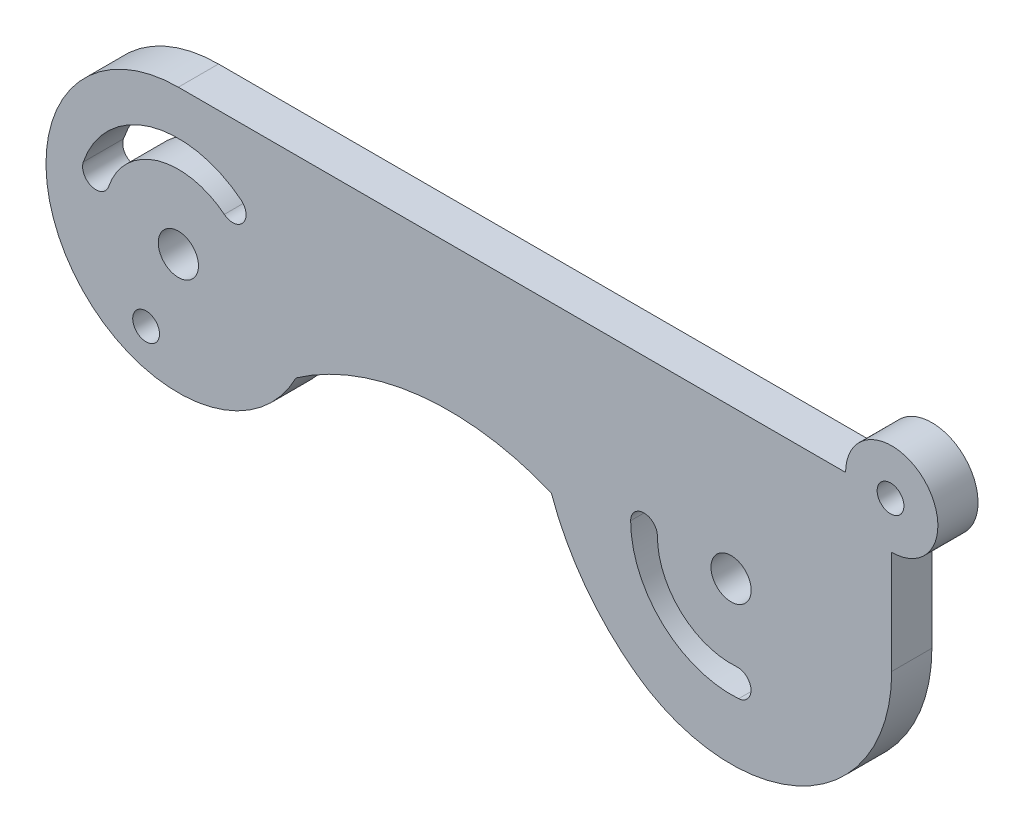
ISO-10303-21;
HEADER;
FILE_DESCRIPTION(('STEP AP214'),'2;1');
FILE_NAME('part.step','',(''),(''),'','','');
FILE_SCHEMA(('AUTOMOTIVE_DESIGN { 1 0 10303 214 1 1 1 1 }'));
ENDSEC;
DATA;
#1=APPLICATION_CONTEXT('core data for automotive mechanical design processes');
#2=APPLICATION_PROTOCOL_DEFINITION('international standard','automotive_design',2000,#1);
#3=PRODUCT_CONTEXT('',#1,'mechanical');
#4=PRODUCT('Part','Part','',(#3));
#5=PRODUCT_RELATED_PRODUCT_CATEGORY('part','',(#4));
#6=PRODUCT_DEFINITION_FORMATION('','',#4);
#7=PRODUCT_DEFINITION_CONTEXT('part definition',#1,'design');
#8=PRODUCT_DEFINITION('design','',#6,#7);
#9=PRODUCT_DEFINITION_SHAPE('','',#8);
#10=(LENGTH_UNIT() NAMED_UNIT(*) SI_UNIT(.MILLI.,.METRE.));
#11=(NAMED_UNIT(*) PLANE_ANGLE_UNIT() SI_UNIT($,.RADIAN.));
#12=(NAMED_UNIT(*) SI_UNIT($,.STERADIAN.) SOLID_ANGLE_UNIT());
#13=UNCERTAINTY_MEASURE_WITH_UNIT(LENGTH_MEASURE(1.E-05),#10,'distance_accuracy_value','');
#14=(GEOMETRIC_REPRESENTATION_CONTEXT(3) GLOBAL_UNCERTAINTY_ASSIGNED_CONTEXT((#13)) GLOBAL_UNIT_ASSIGNED_CONTEXT((#10,
#11,#12)) REPRESENTATION_CONTEXT('',''));
#15=CARTESIAN_POINT('',(0.,0.,0.));
#16=DIRECTION('',(0.,0.,1.));
#17=DIRECTION('',(1.,0.,0.));
#18=AXIS2_PLACEMENT_3D('',#15,#16,#17);
#19=CARTESIAN_POINT('',(44.48908528407,-10.5117961817289,3.));
#20=DIRECTION('',(0.,0.,1.));
#21=DIRECTION('',(1.,0.,0.));
#22=AXIS2_PLACEMENT_3D('',#19,#20,#21);
#23=PLANE('',#22);
#24=CARTESIAN_POINT('',(0.80161913468884,-16.0354079073061,3.));
#25=DIRECTION('',(0.,0.,1.));
#26=DIRECTION('',(1.,0.,0.));
#27=AXIS2_PLACEMENT_3D('',#24,#25,#26);
#28=CIRCLE('',#27,1.);
#29=CARTESIAN_POINT('',(1.80161913468884,-16.0354079073061,3.));
#30=VERTEX_POINT('',#29);
#31=EDGE_CURVE('E377',#30,#30,#28,.T.);
#32=ORIENTED_EDGE('',*,*,#31,.F.);
#33=EDGE_LOOP('',(#32));
#34=FACE_BOUND('',#33,.T.);
#35=CARTESIAN_POINT('',(44.48908528407,-10.5117961817289,3.));
#36=DIRECTION('',(0.,0.,1.));
#37=DIRECTION('',(1.,0.,0.));
#38=AXIS2_PLACEMENT_3D('',#35,#36,#37);
#39=CIRCLE('',#38,7.5);
#40=CARTESIAN_POINT('',(36.98908528407,-10.5117961817289,3.));
#41=VERTEX_POINT('',#40);
#42=CARTESIAN_POINT('',(45.0557519507366,-17.9903581349984,3.));
#43=VERTEX_POINT('',#42);
#44=EDGE_CURVE('E189',#41,#43,#39,.T.);
#45=ORIENTED_EDGE('',*,*,#44,.F.);
#46=CARTESIAN_POINT('',(37.98908528407,-10.5117961817289,3.));
#47=DIRECTION('',(0.,0.,1.));
#48=DIRECTION('',(1.,0.,0.));
#49=AXIS2_PLACEMENT_3D('',#46,#47,#48);
#50=CIRCLE('',#49,1.);
#51=CARTESIAN_POINT('',(38.98908528407,-10.5117961817289,3.));
#52=VERTEX_POINT('',#51);
#53=EDGE_CURVE('E187',#52,#41,#50,.T.);
#54=ORIENTED_EDGE('',*,*,#53,.F.);
#55=CARTESIAN_POINT('',(44.48908528407,-10.5117961817289,3.));
#56=DIRECTION('',(0.,0.,-1.));
#57=DIRECTION('',(1.,0.,0.));
#58=AXIS2_PLACEMENT_3D('',#55,#56,#57);
#59=CIRCLE('',#58,5.5);
#60=CARTESIAN_POINT('',(44.9046408396775,-15.9960749474559,3.));
#61=VERTEX_POINT('',#60);
#62=EDGE_CURVE('E195',#61,#52,#59,.T.);
#63=ORIENTED_EDGE('',*,*,#62,.F.);
#64=CARTESIAN_POINT('',(44.9801963952425,-16.9932165412244,3.));
#65=DIRECTION('',(0.,0.,1.));
#66=DIRECTION('',(-1.,0.,0.));
#67=AXIS2_PLACEMENT_3D('',#64,#65,#66);
#68=CIRCLE('',#67,1.);
#69=EDGE_CURVE('E192',#43,#61,#68,.T.);
#70=ORIENTED_EDGE('',*,*,#69,.F.);
#71=EDGE_LOOP('',(#45,#54,#63,#70));
#72=FACE_BOUND('',#71,.T.);
#73=CARTESIAN_POINT('',(56.3987088279771,0.638507612801557,3.));
#74=DIRECTION('',(0.,0.,1.));
#75=DIRECTION('',(1.,0.,0.));
#76=AXIS2_PLACEMENT_3D('',#73,#74,#75);
#77=CIRCLE('',#76,0.999999999999998);
#78=CARTESIAN_POINT('',(57.3987088279771,0.638507612801557,3.));
#79=VERTEX_POINT('',#78);
#80=EDGE_CURVE('E218',#79,#79,#77,.T.);
#81=ORIENTED_EDGE('',*,*,#80,.F.);
#82=EDGE_LOOP('',(#81));
#83=FACE_BOUND('',#82,.T.);
#84=CARTESIAN_POINT('',(44.48908528407,-10.5117961817289,3.));
#85=DIRECTION('',(0.,0.,1.));
#86=DIRECTION('',(1.,0.,0.));
#87=AXIS2_PLACEMENT_3D('',#84,#85,#86);
#88=CIRCLE('',#87,12.0000000000002);
#89=CARTESIAN_POINT('',(37.4038600068401,-20.196814652073,3.));
#90=VERTEX_POINT('',#89);
#91=CARTESIAN_POINT('',(56.48908528407,-10.5117961817289,3.));
#92=VERTEX_POINT('',#91);
#93=EDGE_CURVE('E230',#90,#92,#88,.T.);
#94=ORIENTED_EDGE('',*,*,#93,.T.);
#95=DIRECTION('',(0.,1.,0.));
#96=VECTOR('',#95,1.);
#97=CARTESIAN_POINT('',(56.48908528407,-2.80772358580675,3.));
#98=LINE('',#97,#96);
#99=CARTESIAN_POINT('',(56.48908528407,-2.80772358580675,3.));
#100=VERTEX_POINT('',#99);
#101=EDGE_CURVE('E233',#92,#100,#98,.T.);
#102=ORIENTED_EDGE('',*,*,#101,.T.);
#103=CARTESIAN_POINT('',(56.48908528407,0.63850761280156,3.));
#104=DIRECTION('',(0.,0.,1.));
#105=DIRECTION('',(1.,0.,0.));
#106=AXIS2_PLACEMENT_3D('',#103,#104,#105);
#107=CIRCLE('',#106,3.4462311986083);
#108=CARTESIAN_POINT('',(53.0428540854617,0.638507612801558,3.));
#109=VERTEX_POINT('',#108);
#110=EDGE_CURVE('E236',#100,#109,#107,.T.);
#111=ORIENTED_EDGE('',*,*,#110,.T.);
#112=DIRECTION('',(-1.,0.,0.));
#113=VECTOR('',#112,1.);
#114=CARTESIAN_POINT('',(53.0428540854617,0.638507612801558,3.));
#115=LINE('',#114,#113);
#116=CARTESIAN_POINT('',(3.20898301396284,0.638507612801559,3.));
#117=VERTEX_POINT('',#116);
#118=EDGE_CURVE('E238',#109,#117,#115,.T.);
#119=ORIENTED_EDGE('',*,*,#118,.T.);
#120=CARTESIAN_POINT('',(3.20898301396284,-9.24751623575377,3.));
#121=DIRECTION('',(0.,0.,1.));
#122=DIRECTION('',(1.,0.,0.));
#123=AXIS2_PLACEMENT_3D('',#120,#121,#122);
#124=CIRCLE('',#123,9.88602384855533);
#125=CARTESIAN_POINT('',(12.0011096475142,-13.7676906564816,3.));
#126=VERTEX_POINT('',#125);
#127=EDGE_CURVE('E240',#117,#126,#124,.T.);
#128=ORIENTED_EDGE('',*,*,#127,.T.);
#129=CARTESIAN_POINT('',(23.4460927902447,-30.169286946557,3.));
#130=DIRECTION('',(0.,0.,-1.));
#131=DIRECTION('',(-1.,0.,0.));
#132=AXIS2_PLACEMENT_3D('',#129,#130,#131);
#133=CIRCLE('',#132,20.);
#134=CARTESIAN_POINT('',(31.0638093902366,-11.6768454148879,3.));
#135=VERTEX_POINT('',#134);
#136=EDGE_CURVE('E242',#126,#135,#133,.T.);
#137=ORIENTED_EDGE('',*,*,#136,.T.);
#138=CARTESIAN_POINT('',(48.0316979226848,-5.66928694655705,3.));
#139=DIRECTION('',(0.,0.,1.));
#140=DIRECTION('',(1.,0.,0.));
#141=AXIS2_PLACEMENT_3D('',#138,#139,#140);
#142=CIRCLE('',#141,18.);
#143=EDGE_CURVE('E244',#135,#90,#142,.T.);
#144=ORIENTED_EDGE('',*,*,#143,.T.);
#145=EDGE_LOOP('',(#94,#102,#111,#119,#128,#137,#144));
#146=FACE_BOUND('',#145,.T.);
#147=CARTESIAN_POINT('',(44.48908528407,-10.5117961817289,3.));
#148=DIRECTION('',(0.,0.,1.));
#149=DIRECTION('',(1.,0.,0.));
#150=AXIS2_PLACEMENT_3D('',#147,#148,#149);
#151=CIRCLE('',#150,1.5);
#152=CARTESIAN_POINT('',(45.98908528407,-10.5117961817289,3.));
#153=VERTEX_POINT('',#152);
#154=EDGE_CURVE('E224',#153,#153,#151,.T.);
#155=ORIENTED_EDGE('',*,*,#154,.F.);
#156=EDGE_LOOP('',(#155));
#157=FACE_BOUND('',#156,.T.);
#158=CARTESIAN_POINT('',(3.20898301396283,-10.169286946557,3.));
#159=DIRECTION('',(0.,0.,1.));
#160=DIRECTION('',(1.,0.,0.));
#161=AXIS2_PLACEMENT_3D('',#158,#159,#160);
#162=CIRCLE('',#161,1.5);
#163=CARTESIAN_POINT('',(4.70898301396283,-10.169286946557,3.));
#164=VERTEX_POINT('',#163);
#165=EDGE_CURVE('E181',#164,#164,#162,.T.);
#166=ORIENTED_EDGE('',*,*,#165,.F.);
#167=EDGE_LOOP('',(#166));
#168=FACE_BOUND('',#167,.T.);
#169=CARTESIAN_POINT('',(3.20898301396283,-10.169286946557,3.));
#170=DIRECTION('',(0.,0.,1.));
#171=DIRECTION('',(1.,0.,0.));
#172=AXIS2_PLACEMENT_3D('',#169,#170,#171);
#173=CIRCLE('',#172,7.5);
#174=CARTESIAN_POINT('',(7.89034571050594,-4.30969282209632,3.));
#175=VERTEX_POINT('',#174);
#176=CARTESIAN_POINT('',(-3.89022161468151,-7.75034220956226,3.));
#177=VERTEX_POINT('',#176);
#178=EDGE_CURVE('E152',#175,#177,#173,.T.);
#179=ORIENTED_EDGE('',*,*,#178,.F.);
#180=CARTESIAN_POINT('',(7.26616401763353,-5.09097203869108,3.));
#181=DIRECTION('',(0.,0.,1.));
#182=DIRECTION('',(-1.,0.,0.));
#183=AXIS2_PLACEMENT_3D('',#180,#181,#182);
#184=CIRCLE('',#183,1.);
#185=CARTESIAN_POINT('',(6.64198232476111,-5.87225125528585,3.));
#186=VERTEX_POINT('',#185);
#187=EDGE_CURVE('E144',#186,#175,#184,.T.);
#188=ORIENTED_EDGE('',*,*,#187,.F.);
#189=CARTESIAN_POINT('',(3.20898301396283,-10.169286946557,3.));
#190=DIRECTION('',(0.,0.,-1.));
#191=DIRECTION('',(1.,0.,0.));
#192=AXIS2_PLACEMENT_3D('',#189,#190,#191);
#193=CIRCLE('',#192,5.5);
#194=CARTESIAN_POINT('',(-1.99710038037635,-8.39539413942753,3.));
#195=VERTEX_POINT('',#194);
#196=EDGE_CURVE('E166',#195,#186,#193,.T.);
#197=ORIENTED_EDGE('',*,*,#196,.F.);
#198=CARTESIAN_POINT('',(-2.94366099752893,-8.07286817449489,3.));
#199=DIRECTION('',(0.,0.,1.));
#200=DIRECTION('',(1.,0.,0.));
#201=AXIS2_PLACEMENT_3D('',#198,#199,#200);
#202=CIRCLE('',#201,1.);
#203=EDGE_CURVE('E164',#177,#195,#202,.T.);
#204=ORIENTED_EDGE('',*,*,#203,.F.);
#205=EDGE_LOOP('',(#179,#188,#197,#204));
#206=FACE_BOUND('',#205,.T.);
#207=ADVANCED_FACE('F36',(#34,#72,#83,#146,#157,#168,#206),#23,.T.);
#208=CARTESIAN_POINT('',(44.48908528407,-10.5117961817289,0.));
#209=DIRECTION('',(0.,0.,1.));
#210=DIRECTION('',(1.,0.,0.));
#211=AXIS2_PLACEMENT_3D('',#208,#209,#210);
#212=PLANE('',#211);
#213=CARTESIAN_POINT('',(0.80161913468884,-16.0354079073061,0.));
#214=DIRECTION('',(0.,0.,1.));
#215=DIRECTION('',(1.,0.,0.));
#216=AXIS2_PLACEMENT_3D('',#213,#214,#215);
#217=CIRCLE('',#216,1.);
#218=CARTESIAN_POINT('',(1.80161913468884,-16.0354079073061,0.));
#219=VERTEX_POINT('',#218);
#220=EDGE_CURVE('E40',#219,#219,#217,.T.);
#221=ORIENTED_EDGE('',*,*,#220,.T.);
#222=EDGE_LOOP('',(#221));
#223=FACE_BOUND('',#222,.T.);
#224=CARTESIAN_POINT('',(3.20898301396283,-10.169286946557,0.));
#225=DIRECTION('',(0.,0.,1.));
#226=DIRECTION('',(1.,0.,0.));
#227=AXIS2_PLACEMENT_3D('',#224,#225,#226);
#228=CIRCLE('',#227,1.5);
#229=CARTESIAN_POINT('',(4.70898301396283,-10.169286946557,0.));
#230=VERTEX_POINT('',#229);
#231=EDGE_CURVE('E160',#230,#230,#228,.T.);
#232=ORIENTED_EDGE('',*,*,#231,.T.);
#233=EDGE_LOOP('',(#232));
#234=FACE_BOUND('',#233,.T.);
#235=CARTESIAN_POINT('',(37.98908528407,-10.5117961817289,0.));
#236=DIRECTION('',(0.,0.,1.));
#237=DIRECTION('',(1.,0.,0.));
#238=AXIS2_PLACEMENT_3D('',#235,#236,#237);
#239=CIRCLE('',#238,1.);
#240=CARTESIAN_POINT('',(38.98908528407,-10.5117961817289,0.));
#241=VERTEX_POINT('',#240);
#242=CARTESIAN_POINT('',(36.98908528407,-10.5117961817289,0.));
#243=VERTEX_POINT('',#242);
#244=EDGE_CURVE('E184',#241,#243,#239,.T.);
#245=ORIENTED_EDGE('',*,*,#244,.T.);
#246=CARTESIAN_POINT('',(44.48908528407,-10.5117961817289,0.));
#247=DIRECTION('',(0.,0.,1.));
#248=DIRECTION('',(1.,0.,0.));
#249=AXIS2_PLACEMENT_3D('',#246,#247,#248);
#250=CIRCLE('',#249,7.5);
#251=CARTESIAN_POINT('',(45.0557519507366,-17.9903581349984,0.));
#252=VERTEX_POINT('',#251);
#253=EDGE_CURVE('E200',#243,#252,#250,.T.);
#254=ORIENTED_EDGE('',*,*,#253,.T.);
#255=CARTESIAN_POINT('',(44.9801963952425,-16.9932165412244,0.));
#256=DIRECTION('',(0.,0.,1.));
#257=DIRECTION('',(-1.,0.,0.));
#258=AXIS2_PLACEMENT_3D('',#255,#256,#257);
#259=CIRCLE('',#258,1.);
#260=CARTESIAN_POINT('',(44.9046408396775,-15.9960749474559,0.));
#261=VERTEX_POINT('',#260);
#262=EDGE_CURVE('E203',#252,#261,#259,.T.);
#263=ORIENTED_EDGE('',*,*,#262,.T.);
#264=CARTESIAN_POINT('',(44.48908528407,-10.5117961817289,0.));
#265=DIRECTION('',(0.,0.,-1.));
#266=DIRECTION('',(1.,0.,0.));
#267=AXIS2_PLACEMENT_3D('',#264,#265,#266);
#268=CIRCLE('',#267,5.5);
#269=EDGE_CURVE('E190',#261,#241,#268,.T.);
#270=ORIENTED_EDGE('',*,*,#269,.T.);
#271=EDGE_LOOP('',(#245,#254,#263,#270));
#272=FACE_BOUND('',#271,.T.);
#273=CARTESIAN_POINT('',(44.48908528407,-10.5117961817289,0.));
#274=DIRECTION('',(0.,0.,1.));
#275=DIRECTION('',(1.,0.,0.));
#276=AXIS2_PLACEMENT_3D('',#273,#274,#275);
#277=CIRCLE('',#276,12.0000000000002);
#278=CARTESIAN_POINT('',(37.4038600068401,-20.196814652073,0.));
#279=VERTEX_POINT('',#278);
#280=CARTESIAN_POINT('',(56.48908528407,-10.5117961817289,0.));
#281=VERTEX_POINT('',#280);
#282=EDGE_CURVE('E227',#279,#281,#277,.T.);
#283=ORIENTED_EDGE('',*,*,#282,.F.);
#284=CARTESIAN_POINT('',(48.0316979226848,-5.66928694655705,0.));
#285=DIRECTION('',(0.,0.,1.));
#286=DIRECTION('',(1.,0.,0.));
#287=AXIS2_PLACEMENT_3D('',#284,#285,#286);
#288=CIRCLE('',#287,18.);
#289=CARTESIAN_POINT('',(31.0638093902366,-11.6768454148879,0.));
#290=VERTEX_POINT('',#289);
#291=EDGE_CURVE('E234',#290,#279,#288,.T.);
#292=ORIENTED_EDGE('',*,*,#291,.F.);
#293=CARTESIAN_POINT('',(23.4460927902447,-30.169286946557,0.));
#294=DIRECTION('',(0.,0.,-1.));
#295=DIRECTION('',(-1.,0.,0.));
#296=AXIS2_PLACEMENT_3D('',#293,#294,#295);
#297=CIRCLE('',#296,20.);
#298=CARTESIAN_POINT('',(12.0011096475142,-13.7676906564816,0.));
#299=VERTEX_POINT('',#298);
#300=EDGE_CURVE('E257',#299,#290,#297,.T.);
#301=ORIENTED_EDGE('',*,*,#300,.F.);
#302=CARTESIAN_POINT('',(3.20898301396284,-9.24751623575377,0.));
#303=DIRECTION('',(0.,0.,1.));
#304=DIRECTION('',(1.,0.,0.));
#305=AXIS2_PLACEMENT_3D('',#302,#303,#304);
#306=CIRCLE('',#305,9.88602384855533);
#307=CARTESIAN_POINT('',(3.20898301396284,0.638507612801559,0.));
#308=VERTEX_POINT('',#307);
#309=EDGE_CURVE('E255',#308,#299,#306,.T.);
#310=ORIENTED_EDGE('',*,*,#309,.F.);
#311=DIRECTION('',(-1.,0.,0.));
#312=VECTOR('',#311,1.);
#313=CARTESIAN_POINT('',(53.0428540854617,0.638507612801558,0.));
#314=LINE('',#313,#312);
#315=CARTESIAN_POINT('',(53.0428540854617,0.638507612801558,0.));
#316=VERTEX_POINT('',#315);
#317=EDGE_CURVE('E253',#316,#308,#314,.T.);
#318=ORIENTED_EDGE('',*,*,#317,.F.);
#319=CARTESIAN_POINT('',(56.48908528407,0.63850761280156,0.));
#320=DIRECTION('',(0.,0.,1.));
#321=DIRECTION('',(1.,0.,0.));
#322=AXIS2_PLACEMENT_3D('',#319,#320,#321);
#323=CIRCLE('',#322,3.4462311986083);
#324=CARTESIAN_POINT('',(56.48908528407,-2.80772358580675,0.));
#325=VERTEX_POINT('',#324);
#326=EDGE_CURVE('E251',#325,#316,#323,.T.);
#327=ORIENTED_EDGE('',*,*,#326,.F.);
#328=DIRECTION('',(0.,1.,0.));
#329=VECTOR('',#328,1.);
#330=CARTESIAN_POINT('',(56.48908528407,-2.80772358580675,0.));
#331=LINE('',#330,#329);
#332=EDGE_CURVE('E249',#281,#325,#331,.T.);
#333=ORIENTED_EDGE('',*,*,#332,.F.);
#334=EDGE_LOOP('',(#283,#292,#301,#310,#318,#327,#333));
#335=FACE_BOUND('',#334,.T.);
#336=CARTESIAN_POINT('',(44.48908528407,-10.5117961817289,0.));
#337=DIRECTION('',(0.,0.,1.));
#338=DIRECTION('',(1.,0.,0.));
#339=AXIS2_PLACEMENT_3D('',#336,#337,#338);
#340=CIRCLE('',#339,1.5);
#341=CARTESIAN_POINT('',(45.98908528407,-10.5117961817289,0.));
#342=VERTEX_POINT('',#341);
#343=EDGE_CURVE('E221',#342,#342,#340,.T.);
#344=ORIENTED_EDGE('',*,*,#343,.T.);
#345=EDGE_LOOP('',(#344));
#346=FACE_BOUND('',#345,.T.);
#347=CARTESIAN_POINT('',(56.3987088279771,0.638507612801557,0.));
#348=DIRECTION('',(0.,0.,1.));
#349=DIRECTION('',(1.,0.,0.));
#350=AXIS2_PLACEMENT_3D('',#347,#348,#349);
#351=CIRCLE('',#350,0.999999999999998);
#352=CARTESIAN_POINT('',(57.3987088279771,0.638507612801557,0.));
#353=VERTEX_POINT('',#352);
#354=EDGE_CURVE('E217',#353,#353,#351,.T.);
#355=ORIENTED_EDGE('',*,*,#354,.T.);
#356=EDGE_LOOP('',(#355));
#357=FACE_BOUND('',#356,.T.);
#358=CARTESIAN_POINT('',(7.26616401763353,-5.09097203869108,0.));
#359=DIRECTION('',(0.,0.,1.));
#360=DIRECTION('',(-1.,0.,0.));
#361=AXIS2_PLACEMENT_3D('',#358,#359,#360);
#362=CIRCLE('',#361,1.);
#363=CARTESIAN_POINT('',(6.64198232476111,-5.87225125528585,0.));
#364=VERTEX_POINT('',#363);
#365=CARTESIAN_POINT('',(7.89034571050594,-4.30969282209632,0.));
#366=VERTEX_POINT('',#365);
#367=EDGE_CURVE('E60',#364,#366,#362,.T.);
#368=ORIENTED_EDGE('',*,*,#367,.T.);
#369=CARTESIAN_POINT('',(3.20898301396283,-10.169286946557,0.));
#370=DIRECTION('',(0.,0.,1.));
#371=DIRECTION('',(1.,0.,0.));
#372=AXIS2_PLACEMENT_3D('',#369,#370,#371);
#373=CIRCLE('',#372,7.5);
#374=CARTESIAN_POINT('',(-3.89022161468151,-7.75034220956226,0.));
#375=VERTEX_POINT('',#374);
#376=EDGE_CURVE('E159',#366,#375,#373,.T.);
#377=ORIENTED_EDGE('',*,*,#376,.T.);
#378=CARTESIAN_POINT('',(-2.94366099752893,-8.07286817449489,0.));
#379=DIRECTION('',(0.,0.,1.));
#380=DIRECTION('',(1.,0.,0.));
#381=AXIS2_PLACEMENT_3D('',#378,#379,#380);
#382=CIRCLE('',#381,1.);
#383=CARTESIAN_POINT('',(-1.99710038037635,-8.39539413942753,0.));
#384=VERTEX_POINT('',#383);
#385=EDGE_CURVE('E173',#375,#384,#382,.T.);
#386=ORIENTED_EDGE('',*,*,#385,.T.);
#387=CARTESIAN_POINT('',(3.20898301396283,-10.169286946557,0.));
#388=DIRECTION('',(0.,0.,-1.));
#389=DIRECTION('',(1.,0.,0.));
#390=AXIS2_PLACEMENT_3D('',#387,#388,#389);
#391=CIRCLE('',#390,5.5);
#392=EDGE_CURVE('E153',#384,#364,#391,.T.);
#393=ORIENTED_EDGE('',*,*,#392,.T.);
#394=EDGE_LOOP('',(#368,#377,#386,#393));
#395=FACE_BOUND('',#394,.T.);
#396=ADVANCED_FACE('F285',(#223,#234,#272,#335,#346,#357,#395),#212,.F.);
#397=CARTESIAN_POINT('',(44.48908528407,-10.5117961817289,3.));
#398=DIRECTION('',(0.,0.,-1.));
#399=DIRECTION('',(-1.,0.,0.));
#400=AXIS2_PLACEMENT_3D('',#397,#398,#399);
#401=CYLINDRICAL_SURFACE('',#400,12.0000000000002);
#402=ORIENTED_EDGE('',*,*,#282,.T.);
#403=DIRECTION('',(0.,0.,-1.));
#404=VECTOR('',#403,1.);
#405=CARTESIAN_POINT('',(56.48908528407,-10.5117961817289,3.));
#406=LINE('',#405,#404);
#407=EDGE_CURVE('E11',#92,#281,#406,.T.);
#408=ORIENTED_EDGE('',*,*,#407,.F.);
#409=ORIENTED_EDGE('',*,*,#93,.F.);
#410=DIRECTION('',(0.,0.,-1.));
#411=VECTOR('',#410,1.);
#412=CARTESIAN_POINT('',(37.4038600068401,-20.196814652073,3.));
#413=LINE('',#412,#411);
#414=EDGE_CURVE('E246',#90,#279,#413,.T.);
#415=ORIENTED_EDGE('',*,*,#414,.T.);
#416=EDGE_LOOP('',(#402,#408,#409,#415));
#417=FACE_BOUND('',#416,.T.);
#418=ADVANCED_FACE('F38',(#417),#401,.T.);
#419=CARTESIAN_POINT('',(56.48908528407,-2.80772358580675,3.));
#420=DIRECTION('',(-1.,0.,0.));
#421=DIRECTION('',(0.,0.,1.));
#422=AXIS2_PLACEMENT_3D('',#419,#420,#421);
#423=PLANE('',#422);
#424=ORIENTED_EDGE('',*,*,#332,.T.);
#425=DIRECTION('',(0.,0.,-1.));
#426=VECTOR('',#425,1.);
#427=CARTESIAN_POINT('',(56.48908528407,-2.80772358580675,3.));
#428=LINE('',#427,#426);
#429=EDGE_CURVE('E45',#100,#325,#428,.T.);
#430=ORIENTED_EDGE('',*,*,#429,.F.);
#431=ORIENTED_EDGE('',*,*,#101,.F.);
#432=ORIENTED_EDGE('',*,*,#407,.T.);
#433=EDGE_LOOP('',(#424,#430,#431,#432));
#434=FACE_BOUND('',#433,.T.);
#435=ADVANCED_FACE('F303',(#434),#423,.F.);
#436=CARTESIAN_POINT('',(56.48908528407,0.63850761280156,3.));
#437=DIRECTION('',(0.,0.,-1.));
#438=DIRECTION('',(-1.,0.,0.));
#439=AXIS2_PLACEMENT_3D('',#436,#437,#438);
#440=CYLINDRICAL_SURFACE('',#439,3.4462311986083);
#441=ORIENTED_EDGE('',*,*,#326,.T.);
#442=DIRECTION('',(0.,0.,-1.));
#443=VECTOR('',#442,1.);
#444=CARTESIAN_POINT('',(53.0428540854617,0.638507612801558,3.));
#445=LINE('',#444,#443);
#446=EDGE_CURVE('E271',#109,#316,#445,.T.);
#447=ORIENTED_EDGE('',*,*,#446,.F.);
#448=ORIENTED_EDGE('',*,*,#110,.F.);
#449=ORIENTED_EDGE('',*,*,#429,.T.);
#450=EDGE_LOOP('',(#441,#447,#448,#449));
#451=FACE_BOUND('',#450,.T.);
#452=ADVANCED_FACE('F279',(#451),#440,.T.);
#453=CARTESIAN_POINT('',(53.0428540854617,0.638507612801558,3.));
#454=DIRECTION('',(0.,-1.,0.));
#455=DIRECTION('',(1.,0.,0.));
#456=AXIS2_PLACEMENT_3D('',#453,#454,#455);
#457=PLANE('',#456);
#458=ORIENTED_EDGE('',*,*,#317,.T.);
#459=DIRECTION('',(0.,0.,-1.));
#460=VECTOR('',#459,1.);
#461=CARTESIAN_POINT('',(3.20898301396284,0.638507612801559,3.));
#462=LINE('',#461,#460);
#463=EDGE_CURVE('E268',#117,#308,#462,.T.);
#464=ORIENTED_EDGE('',*,*,#463,.F.);
#465=ORIENTED_EDGE('',*,*,#118,.F.);
#466=ORIENTED_EDGE('',*,*,#446,.T.);
#467=EDGE_LOOP('',(#458,#464,#465,#466));
#468=FACE_BOUND('',#467,.T.);
#469=ADVANCED_FACE('F291',(#468),#457,.F.);
#470=CARTESIAN_POINT('',(3.20898301396284,-9.24751623575377,3.));
#471=DIRECTION('',(0.,0.,-1.));
#472=DIRECTION('',(-1.,0.,0.));
#473=AXIS2_PLACEMENT_3D('',#470,#471,#472);
#474=CYLINDRICAL_SURFACE('',#473,9.88602384855533);
#475=ORIENTED_EDGE('',*,*,#309,.T.);
#476=DIRECTION('',(0.,0.,-1.));
#477=VECTOR('',#476,1.);
#478=CARTESIAN_POINT('',(12.0011096475142,-13.7676906564816,3.));
#479=LINE('',#478,#477);
#480=EDGE_CURVE('E265',#126,#299,#479,.T.);
#481=ORIENTED_EDGE('',*,*,#480,.F.);
#482=ORIENTED_EDGE('',*,*,#127,.F.);
#483=ORIENTED_EDGE('',*,*,#463,.T.);
#484=EDGE_LOOP('',(#475,#481,#482,#483));
#485=FACE_BOUND('',#484,.T.);
#486=ADVANCED_FACE('F295',(#485),#474,.T.);
#487=CARTESIAN_POINT('',(23.4460927902447,-30.169286946557,3.));
#488=DIRECTION('',(0.,0.,-1.));
#489=DIRECTION('',(-1.,0.,0.));
#490=AXIS2_PLACEMENT_3D('',#487,#488,#489);
#491=CYLINDRICAL_SURFACE('',#490,20.);
#492=ORIENTED_EDGE('',*,*,#300,.T.);
#493=DIRECTION('',(0.,0.,-1.));
#494=VECTOR('',#493,1.);
#495=CARTESIAN_POINT('',(31.0638093902366,-11.6768454148879,3.));
#496=LINE('',#495,#494);
#497=EDGE_CURVE('E262',#135,#290,#496,.T.);
#498=ORIENTED_EDGE('',*,*,#497,.F.);
#499=ORIENTED_EDGE('',*,*,#136,.F.);
#500=ORIENTED_EDGE('',*,*,#480,.T.);
#501=EDGE_LOOP('',(#492,#498,#499,#500));
#502=FACE_BOUND('',#501,.T.);
#503=ADVANCED_FACE('F311',(#502),#491,.F.);
#504=CARTESIAN_POINT('',(48.0316979226848,-5.66928694655705,3.));
#505=DIRECTION('',(0.,0.,-1.));
#506=DIRECTION('',(-1.,0.,0.));
#507=AXIS2_PLACEMENT_3D('',#504,#505,#506);
#508=CYLINDRICAL_SURFACE('',#507,18.);
#509=ORIENTED_EDGE('',*,*,#291,.T.);
#510=ORIENTED_EDGE('',*,*,#414,.F.);
#511=ORIENTED_EDGE('',*,*,#143,.F.);
#512=ORIENTED_EDGE('',*,*,#497,.T.);
#513=EDGE_LOOP('',(#509,#510,#511,#512));
#514=FACE_BOUND('',#513,.T.);
#515=ADVANCED_FACE('F308',(#514),#508,.T.);
#516=CARTESIAN_POINT('',(44.48908528407,-10.5117961817289,3.));
#517=DIRECTION('',(0.,0.,-1.));
#518=DIRECTION('',(-1.,0.,0.));
#519=AXIS2_PLACEMENT_3D('',#516,#517,#518);
#520=CYLINDRICAL_SURFACE('',#519,1.5);
#521=ORIENTED_EDGE('',*,*,#154,.T.);
#522=EDGE_LOOP('',(#521));
#523=FACE_BOUND('',#522,.T.);
#524=ORIENTED_EDGE('',*,*,#343,.F.);
#525=EDGE_LOOP('',(#524));
#526=FACE_BOUND('',#525,.T.);
#527=ADVANCED_FACE('F318',(#523,#526),#520,.F.);
#528=CARTESIAN_POINT('',(56.3987088279771,0.638507612801557,3.));
#529=DIRECTION('',(0.,0.,-1.));
#530=DIRECTION('',(-1.,0.,0.));
#531=AXIS2_PLACEMENT_3D('',#528,#529,#530);
#532=CYLINDRICAL_SURFACE('',#531,0.999999999999998);
#533=ORIENTED_EDGE('',*,*,#80,.T.);
#534=EDGE_LOOP('',(#533));
#535=FACE_BOUND('',#534,.T.);
#536=ORIENTED_EDGE('',*,*,#354,.F.);
#537=EDGE_LOOP('',(#536));
#538=FACE_BOUND('',#537,.T.);
#539=ADVANCED_FACE('F334',(#535,#538),#532,.F.);
#540=CARTESIAN_POINT('',(37.98908528407,-10.5117961817289,3.));
#541=DIRECTION('',(0.,0.,-1.));
#542=DIRECTION('',(-1.,0.,0.));
#543=AXIS2_PLACEMENT_3D('',#540,#541,#542);
#544=CYLINDRICAL_SURFACE('',#543,1.);
#545=ORIENTED_EDGE('',*,*,#244,.F.);
#546=DIRECTION('',(0.,0.,-1.));
#547=VECTOR('',#546,1.);
#548=CARTESIAN_POINT('',(38.98908528407,-10.5117961817289,3.));
#549=LINE('',#548,#547);
#550=EDGE_CURVE('E197',#52,#241,#549,.T.);
#551=ORIENTED_EDGE('',*,*,#550,.F.);
#552=ORIENTED_EDGE('',*,*,#53,.T.);
#553=DIRECTION('',(0.,0.,-1.));
#554=VECTOR('',#553,1.);
#555=CARTESIAN_POINT('',(36.98908528407,-10.5117961817289,3.));
#556=LINE('',#555,#554);
#557=EDGE_CURVE('E214',#41,#243,#556,.T.);
#558=ORIENTED_EDGE('',*,*,#557,.T.);
#559=EDGE_LOOP('',(#545,#551,#552,#558));
#560=FACE_BOUND('',#559,.T.);
#561=ADVANCED_FACE('F338',(#560),#544,.F.);
#562=CARTESIAN_POINT('',(44.48908528407,-10.5117961817289,3.));
#563=DIRECTION('',(0.,0.,-1.));
#564=DIRECTION('',(-1.,0.,0.));
#565=AXIS2_PLACEMENT_3D('',#562,#563,#564);
#566=CYLINDRICAL_SURFACE('',#565,7.5);
#567=ORIENTED_EDGE('',*,*,#253,.F.);
#568=ORIENTED_EDGE('',*,*,#557,.F.);
#569=ORIENTED_EDGE('',*,*,#44,.T.);
#570=DIRECTION('',(0.,0.,-1.));
#571=VECTOR('',#570,1.);
#572=CARTESIAN_POINT('',(45.0557519507366,-17.9903581349984,3.));
#573=LINE('',#572,#571);
#574=EDGE_CURVE('E212',#43,#252,#573,.T.);
#575=ORIENTED_EDGE('',*,*,#574,.T.);
#576=EDGE_LOOP('',(#567,#568,#569,#575));
#577=FACE_BOUND('',#576,.T.);
#578=ADVANCED_FACE('F342',(#577),#566,.F.);
#579=CARTESIAN_POINT('',(44.9801963952425,-16.9932165412244,3.));
#580=DIRECTION('',(0.,0.,-1.));
#581=DIRECTION('',(-1.,0.,0.));
#582=AXIS2_PLACEMENT_3D('',#579,#580,#581);
#583=CYLINDRICAL_SURFACE('',#582,1.);
#584=ORIENTED_EDGE('',*,*,#262,.F.);
#585=ORIENTED_EDGE('',*,*,#574,.F.);
#586=ORIENTED_EDGE('',*,*,#69,.T.);
#587=DIRECTION('',(0.,0.,-1.));
#588=VECTOR('',#587,1.);
#589=CARTESIAN_POINT('',(44.9046408396775,-15.9960749474559,3.));
#590=LINE('',#589,#588);
#591=EDGE_CURVE('E210',#61,#261,#590,.T.);
#592=ORIENTED_EDGE('',*,*,#591,.T.);
#593=EDGE_LOOP('',(#584,#585,#586,#592));
#594=FACE_BOUND('',#593,.T.);
#595=ADVANCED_FACE('F346',(#594),#583,.F.);
#596=CARTESIAN_POINT('',(44.48908528407,-10.5117961817289,3.));
#597=DIRECTION('',(0.,0.,-1.));
#598=DIRECTION('',(-1.,0.,0.));
#599=AXIS2_PLACEMENT_3D('',#596,#597,#598);
#600=CYLINDRICAL_SURFACE('',#599,5.5);
#601=ORIENTED_EDGE('',*,*,#269,.F.);
#602=ORIENTED_EDGE('',*,*,#591,.F.);
#603=ORIENTED_EDGE('',*,*,#62,.T.);
#604=ORIENTED_EDGE('',*,*,#550,.T.);
#605=EDGE_LOOP('',(#601,#602,#603,#604));
#606=FACE_BOUND('',#605,.T.);
#607=ADVANCED_FACE('F350',(#606),#600,.T.);
#608=CARTESIAN_POINT('',(3.20898301396283,-10.169286946557,3.));
#609=DIRECTION('',(0.,0.,-1.));
#610=DIRECTION('',(-1.,0.,0.));
#611=AXIS2_PLACEMENT_3D('',#608,#609,#610);
#612=CYLINDRICAL_SURFACE('',#611,1.5);
#613=ORIENTED_EDGE('',*,*,#165,.T.);
#614=EDGE_LOOP('',(#613));
#615=FACE_BOUND('',#614,.T.);
#616=ORIENTED_EDGE('',*,*,#231,.F.);
#617=EDGE_LOOP('',(#616));
#618=FACE_BOUND('',#617,.T.);
#619=ADVANCED_FACE('F354',(#615,#618),#612,.F.);
#620=CARTESIAN_POINT('',(7.26616401763353,-5.09097203869108,3.));
#621=DIRECTION('',(0.,0.,-1.));
#622=DIRECTION('',(-1.,0.,0.));
#623=AXIS2_PLACEMENT_3D('',#620,#621,#622);
#624=CYLINDRICAL_SURFACE('',#623,1.);
#625=ORIENTED_EDGE('',*,*,#367,.F.);
#626=DIRECTION('',(0.,0.,-1.));
#627=VECTOR('',#626,1.);
#628=CARTESIAN_POINT('',(6.64198232476111,-5.87225125528585,3.));
#629=LINE('',#628,#627);
#630=EDGE_CURVE('E148',#186,#364,#629,.T.);
#631=ORIENTED_EDGE('',*,*,#630,.F.);
#632=ORIENTED_EDGE('',*,*,#187,.T.);
#633=DIRECTION('',(0.,0.,-1.));
#634=VECTOR('',#633,1.);
#635=CARTESIAN_POINT('',(7.89034571050594,-4.30969282209632,3.));
#636=LINE('',#635,#634);
#637=EDGE_CURVE('E147',#175,#366,#636,.T.);
#638=ORIENTED_EDGE('',*,*,#637,.T.);
#639=EDGE_LOOP('',(#625,#631,#632,#638));
#640=FACE_BOUND('',#639,.T.);
#641=ADVANCED_FACE('F146',(#640),#624,.F.);
#642=CARTESIAN_POINT('',(3.20898301396283,-10.169286946557,3.));
#643=DIRECTION('',(0.,0.,-1.));
#644=DIRECTION('',(-1.,0.,0.));
#645=AXIS2_PLACEMENT_3D('',#642,#643,#644);
#646=CYLINDRICAL_SURFACE('',#645,7.5);
#647=ORIENTED_EDGE('',*,*,#376,.F.);
#648=ORIENTED_EDGE('',*,*,#637,.F.);
#649=ORIENTED_EDGE('',*,*,#178,.T.);
#650=DIRECTION('',(0.,0.,-1.));
#651=VECTOR('',#650,1.);
#652=CARTESIAN_POINT('',(-3.89022161468151,-7.75034220956226,3.));
#653=LINE('',#652,#651);
#654=EDGE_CURVE('E161',#177,#375,#653,.T.);
#655=ORIENTED_EDGE('',*,*,#654,.T.);
#656=EDGE_LOOP('',(#647,#648,#649,#655));
#657=FACE_BOUND('',#656,.T.);
#658=ADVANCED_FACE('F156',(#657),#646,.F.);
#659=CARTESIAN_POINT('',(-2.94366099752893,-8.07286817449489,3.));
#660=DIRECTION('',(0.,0.,-1.));
#661=DIRECTION('',(-1.,0.,0.));
#662=AXIS2_PLACEMENT_3D('',#659,#660,#661);
#663=CYLINDRICAL_SURFACE('',#662,1.);
#664=ORIENTED_EDGE('',*,*,#385,.F.);
#665=ORIENTED_EDGE('',*,*,#654,.F.);
#666=ORIENTED_EDGE('',*,*,#203,.T.);
#667=DIRECTION('',(0.,0.,-1.));
#668=VECTOR('',#667,1.);
#669=CARTESIAN_POINT('',(-1.99710038037635,-8.39539413942753,3.));
#670=LINE('',#669,#668);
#671=EDGE_CURVE('E52',#195,#384,#670,.T.);
#672=ORIENTED_EDGE('',*,*,#671,.T.);
#673=EDGE_LOOP('',(#664,#665,#666,#672));
#674=FACE_BOUND('',#673,.T.);
#675=ADVANCED_FACE('F363',(#674),#663,.F.);
#676=CARTESIAN_POINT('',(3.20898301396283,-10.169286946557,3.));
#677=DIRECTION('',(0.,0.,-1.));
#678=DIRECTION('',(-1.,0.,0.));
#679=AXIS2_PLACEMENT_3D('',#676,#677,#678);
#680=CYLINDRICAL_SURFACE('',#679,5.5);
#681=ORIENTED_EDGE('',*,*,#392,.F.);
#682=ORIENTED_EDGE('',*,*,#671,.F.);
#683=ORIENTED_EDGE('',*,*,#196,.T.);
#684=ORIENTED_EDGE('',*,*,#630,.T.);
#685=EDGE_LOOP('',(#681,#682,#683,#684));
#686=FACE_BOUND('',#685,.T.);
#687=ADVANCED_FACE('F366',(#686),#680,.T.);
#688=CARTESIAN_POINT('',(0.80161913468884,-16.0354079073061,-7.));
#689=DIRECTION('',(0.,0.,1.));
#690=DIRECTION('',(1.,0.,0.));
#691=AXIS2_PLACEMENT_3D('',#688,#689,#690);
#692=CYLINDRICAL_SURFACE('',#691,1.);
#693=ORIENTED_EDGE('',*,*,#31,.T.);
#694=EDGE_LOOP('',(#693));
#695=FACE_BOUND('',#694,.T.);
#696=ORIENTED_EDGE('',*,*,#220,.F.);
#697=EDGE_LOOP('',(#696));
#698=FACE_BOUND('',#697,.T.);
#699=ADVANCED_FACE('F370',(#695,#698),#692,.F.);
#700=CLOSED_SHELL('',(#207,#396,#418,#435,#452,#469,#486,#503,#515,#527,#539,#561,#578,#595,
#607,#619,#641,#658,#675,#687,#699));
#701=MANIFOLD_SOLID_BREP('B2',#700);
#702=ADVANCED_BREP_SHAPE_REPRESENTATION('',(#18,#701),#14);
#703=SHAPE_DEFINITION_REPRESENTATION(#9,#702);
ENDSEC;
END-ISO-10303-21;
